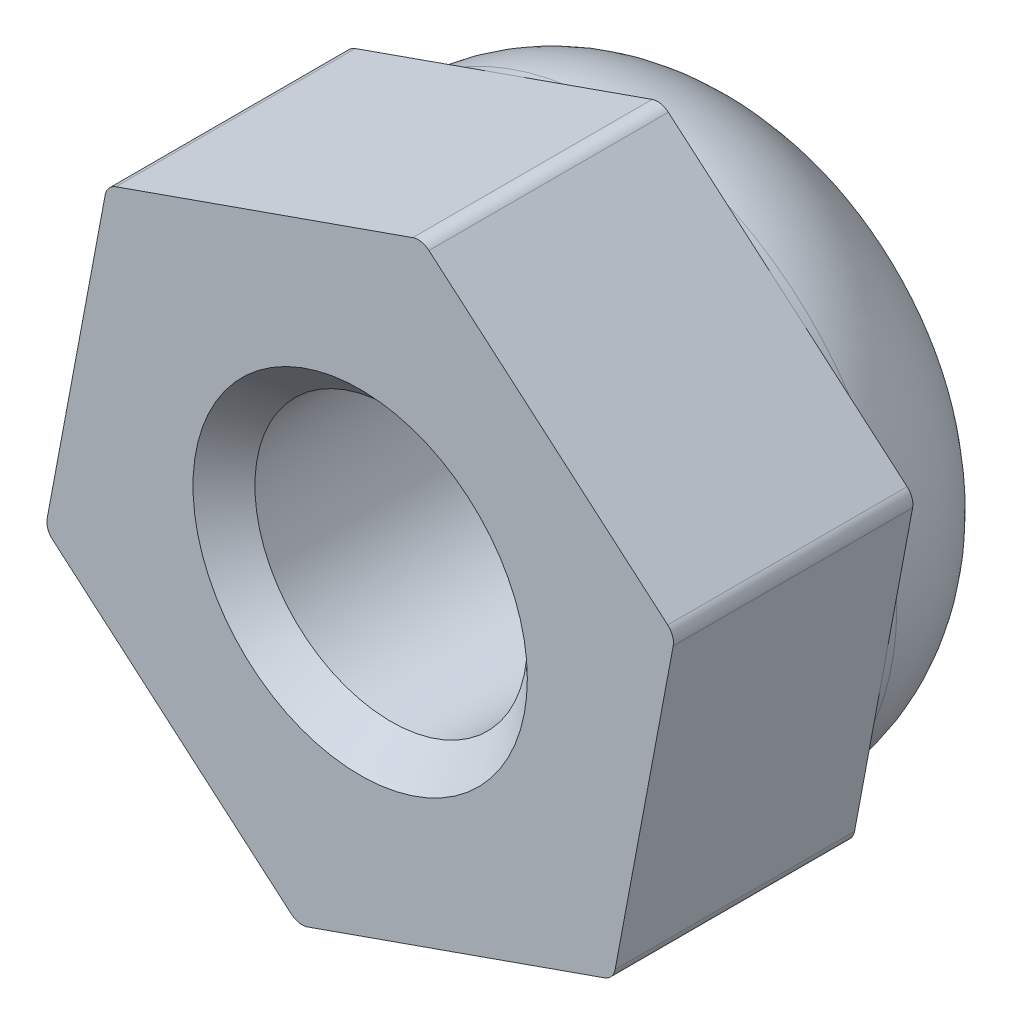
ISO-10303-21;
HEADER;
FILE_DESCRIPTION(('STEP AP214'),'2;1');
FILE_NAME('part.step','',(''),(''),'','','');
FILE_SCHEMA(('AUTOMOTIVE_DESIGN { 1 0 10303 214 1 1 1 1 }'));
ENDSEC;
DATA;
#1=APPLICATION_CONTEXT('core data for automotive mechanical design processes');
#2=APPLICATION_PROTOCOL_DEFINITION('international standard','automotive_design',2000,#1);
#3=PRODUCT_CONTEXT('',#1,'mechanical');
#4=PRODUCT('Part','Part','',(#3));
#5=PRODUCT_RELATED_PRODUCT_CATEGORY('part','',(#4));
#6=PRODUCT_DEFINITION_FORMATION('','',#4);
#7=PRODUCT_DEFINITION_CONTEXT('part definition',#1,'design');
#8=PRODUCT_DEFINITION('design','',#6,#7);
#9=PRODUCT_DEFINITION_SHAPE('','',#8);
#10=(LENGTH_UNIT() NAMED_UNIT(*) SI_UNIT(.MILLI.,.METRE.));
#11=(NAMED_UNIT(*) PLANE_ANGLE_UNIT() SI_UNIT($,.RADIAN.));
#12=(NAMED_UNIT(*) SI_UNIT($,.STERADIAN.) SOLID_ANGLE_UNIT());
#13=UNCERTAINTY_MEASURE_WITH_UNIT(LENGTH_MEASURE(1.E-05),#10,'distance_accuracy_value','');
#14=(GEOMETRIC_REPRESENTATION_CONTEXT(3) GLOBAL_UNCERTAINTY_ASSIGNED_CONTEXT((#13)) GLOBAL_UNIT_ASSIGNED_CONTEXT((#10,
#11,#12)) REPRESENTATION_CONTEXT('',''));
#15=CARTESIAN_POINT('',(0.,0.,0.));
#16=DIRECTION('',(0.,0.,1.));
#17=DIRECTION('',(1.,0.,0.));
#18=AXIS2_PLACEMENT_3D('',#15,#16,#17);
#19=CARTESIAN_POINT('',(0.,0.,0.));
#20=DIRECTION('',(0.,0.,1.));
#21=DIRECTION('',(1.,0.,0.));
#22=AXIS2_PLACEMENT_3D('',#19,#20,#21);
#23=PLANE('',#22);
#24=DIRECTION('',(-0.943398811601491,-0.331660492475205,0.));
#25=VECTOR('',#24,1.);
#26=CARTESIAN_POINT('',(0.745538728746312,3.97209080174065,0.));
#27=LINE('',#26,#25);
#28=CARTESIAN_POINT('',(0.636604417180052,3.93379394681862,0.));
#29=VERTEX_POINT('',#28);
#30=CARTESIAN_POINT('',(-1.16081172366322,3.30189584060522,0.));
#31=VERTEX_POINT('',#30);
#32=EDGE_CURVE('E199',#29,#31,#27,.T.);
#33=ORIENTED_EDGE('',*,*,#32,.F.);
#34=CARTESIAN_POINT('',(0.702936515675093,3.74511418449833,0.));
#35=DIRECTION('',(0.,0.,1.));
#36=DIRECTION('',(1.,0.,0.));
#37=AXIS2_PLACEMENT_3D('',#34,#35,#36);
#38=CIRCLE('',#37,0.2);
#39=CARTESIAN_POINT('',(0.833171933776962,3.89689934804151,0.));
#40=VERTEX_POINT('',#39);
#41=EDGE_CURVE('E264',#29,#40,#38,.F.);
#42=ORIENTED_EDGE('',*,*,#41,.T.);
#43=DIRECTION('',(-0.75892581771593,0.651177090509338,0.));
#44=VECTOR('',#43,1.);
#45=CARTESIAN_POINT('',(3.81270090481906,1.34038992227086,0.));
#46=LINE('',#45,#44);
#47=CARTESIAN_POINT('',(2.27911981678268,2.65624036200576,0.));
#48=VERTEX_POINT('',#47);
#49=EDGE_CURVE('E161',#48,#40,#46,.T.);
#50=ORIENTED_EDGE('',*,*,#49,.F.);
#51=CARTESIAN_POINT('',(0.,0.,0.));
#52=DIRECTION('',(0.,0.,1.));
#53=DIRECTION('',(1.,0.,0.));
#54=AXIS2_PLACEMENT_3D('',#51,#52,#53);
#55=CIRCLE('',#54,3.5);
#56=EDGE_CURVE('E174',#48,#31,#55,.T.);
#57=ORIENTED_EDGE('',*,*,#56,.T.);
#58=EDGE_LOOP('',(#33,#42,#50,#57));
#59=FACE_BOUND('',#58,.T.);
#60=ADVANCED_FACE('F40',(#59),#23,.F.);
#61=DIRECTION('',(-0.18447299388556,-0.982837582984543,0.));
#62=VECTOR('',#61,1.);
#63=CARTESIAN_POINT('',(-3.06716217607274,2.63170087946979,0.));
#64=LINE('',#63,#62);
#65=CARTESIAN_POINT('',(-3.08846328260835,2.51821257084862,0.));
#66=VERTEX_POINT('',#65);
#67=CARTESIAN_POINT('',(-3.4399315404459,0.645655478599461,0.));
#68=VERTEX_POINT('',#67);
#69=EDGE_CURVE('E203',#66,#68,#64,.T.);
#70=ORIENTED_EDGE('',*,*,#69,.F.);
#71=CARTESIAN_POINT('',(-2.89189576601144,2.48131797207151,0.));
#72=DIRECTION('',(0.,0.,1.));
#73=DIRECTION('',(1.,0.,0.));
#74=AXIS2_PLACEMENT_3D('',#71,#72,#73);
#75=CIRCLE('',#74,0.2);
#76=CARTESIAN_POINT('',(-2.95822786450649,2.66999773439181,0.));
#77=VERTEX_POINT('',#76);
#78=EDGE_CURVE('E274',#66,#77,#75,.F.);
#79=ORIENTED_EDGE('',*,*,#78,.T.);
#80=EDGE_CURVE('E198',#31,#77,#27,.T.);
#81=ORIENTED_EDGE('',*,*,#80,.F.);
#82=EDGE_CURVE('E421',#31,#68,#55,.T.);
#83=ORIENTED_EDGE('',*,*,#82,.T.);
#84=EDGE_LOOP('',(#70,#79,#81,#83));
#85=FACE_BOUND('',#84,.T.);
#86=ADVANCED_FACE('F350',(#85),#23,.F.);
#87=DIRECTION('',(0.75892581771593,-0.651177090509338,0.));
#88=VECTOR('',#87,1.);
#89=CARTESIAN_POINT('',(-3.81270090481905,-1.34038992227086,0.));
#90=LINE('',#89,#88);
#91=CARTESIAN_POINT('',(-3.7250676997884,-1.41558137597,0.));
#92=VERTEX_POINT('',#91);
#93=CARTESIAN_POINT('',(-2.27911981678268,-2.65624036200576,0.));
#94=VERTEX_POINT('',#93);
#95=EDGE_CURVE('E207',#92,#94,#90,.T.);
#96=ORIENTED_EDGE('',*,*,#95,.F.);
#97=CARTESIAN_POINT('',(-3.59483228168654,-1.26379621242681,0.));
#98=DIRECTION('',(0.,0.,1.));
#99=DIRECTION('',(1.,0.,0.));
#100=AXIS2_PLACEMENT_3D('',#97,#98,#99);
#101=CIRCLE('',#100,0.2);
#102=CARTESIAN_POINT('',(-3.79139979828345,-1.2269016136497,0.));
#103=VERTEX_POINT('',#102);
#104=EDGE_CURVE('E50',#92,#103,#101,.F.);
#105=ORIENTED_EDGE('',*,*,#104,.T.);
#106=EDGE_CURVE('E202',#68,#103,#64,.T.);
#107=ORIENTED_EDGE('',*,*,#106,.F.);
#108=EDGE_CURVE('E423',#68,#94,#55,.T.);
#109=ORIENTED_EDGE('',*,*,#108,.T.);
#110=EDGE_LOOP('',(#96,#105,#107,#109));
#111=FACE_BOUND('',#110,.T.);
#112=ADVANCED_FACE('F288',(#111),#23,.F.);
#113=DIRECTION('',(0.943398811601491,0.331660492475205,0.));
#114=VECTOR('',#113,1.);
#115=CARTESIAN_POINT('',(-0.74553872874631,-3.97209080174065,0.));
#116=LINE('',#115,#114);
#117=CARTESIAN_POINT('',(-0.636604417180051,-3.93379394681862,0.));
#118=VERTEX_POINT('',#117);
#119=CARTESIAN_POINT('',(1.16081172366322,-3.30189584060522,0.));
#120=VERTEX_POINT('',#119);
#121=EDGE_CURVE('E190',#118,#120,#116,.T.);
#122=ORIENTED_EDGE('',*,*,#121,.F.);
#123=CARTESIAN_POINT('',(-0.702936515675092,-3.74511418449833,0.));
#124=DIRECTION('',(0.,0.,1.));
#125=DIRECTION('',(1.,0.,0.));
#126=AXIS2_PLACEMENT_3D('',#123,#124,#125);
#127=CIRCLE('',#126,0.2);
#128=CARTESIAN_POINT('',(-0.833171933776959,-3.89689934804151,0.));
#129=VERTEX_POINT('',#128);
#130=EDGE_CURVE('E11',#118,#129,#127,.F.);
#131=ORIENTED_EDGE('',*,*,#130,.T.);
#132=EDGE_CURVE('E206',#94,#129,#90,.T.);
#133=ORIENTED_EDGE('',*,*,#132,.F.);
#134=EDGE_CURVE('E186',#94,#120,#55,.T.);
#135=ORIENTED_EDGE('',*,*,#134,.T.);
#136=EDGE_LOOP('',(#122,#131,#133,#135));
#137=FACE_BOUND('',#136,.T.);
#138=ADVANCED_FACE('F427',(#137),#23,.F.);
#139=DIRECTION('',(0.18447299388556,0.982837582984543,0.));
#140=VECTOR('',#139,1.);
#141=CARTESIAN_POINT('',(3.06716217607274,-2.63170087946979,0.));
#142=LINE('',#141,#140);
#143=CARTESIAN_POINT('',(3.08846328260835,-2.51821257084862,0.));
#144=VERTEX_POINT('',#143);
#145=CARTESIAN_POINT('',(3.4399315404459,-0.64565547859946,0.));
#146=VERTEX_POINT('',#145);
#147=EDGE_CURVE('E149',#144,#146,#142,.T.);
#148=ORIENTED_EDGE('',*,*,#147,.F.);
#149=CARTESIAN_POINT('',(2.89189576601145,-2.48131797207151,0.));
#150=DIRECTION('',(0.,0.,1.));
#151=DIRECTION('',(1.,0.,0.));
#152=AXIS2_PLACEMENT_3D('',#149,#150,#151);
#153=CIRCLE('',#152,0.2);
#154=CARTESIAN_POINT('',(2.95822786450649,-2.66999773439181,0.));
#155=VERTEX_POINT('',#154);
#156=EDGE_CURVE('E220',#144,#155,#153,.F.);
#157=ORIENTED_EDGE('',*,*,#156,.T.);
#158=EDGE_CURVE('E184',#120,#155,#116,.T.);
#159=ORIENTED_EDGE('',*,*,#158,.F.);
#160=EDGE_CURVE('E170',#120,#146,#55,.T.);
#161=ORIENTED_EDGE('',*,*,#160,.T.);
#162=EDGE_LOOP('',(#148,#157,#159,#161));
#163=FACE_BOUND('',#162,.T.);
#164=ADVANCED_FACE('F182',(#163),#23,.F.);
#165=CARTESIAN_POINT('',(-0.74553872874631,-3.97209080174065,2.9));
#166=DIRECTION('',(-0.331660492475205,0.943398811601491,0.));
#167=DIRECTION('',(-0.943398811601491,-0.331660492475205,0.));
#168=AXIS2_PLACEMENT_3D('',#165,#166,#167);
#169=PLANE('',#168);
#170=ORIENTED_EDGE('',*,*,#158,.T.);
#171=DIRECTION('',(0.,0.,-1.));
#172=VECTOR('',#171,1.);
#173=CARTESIAN_POINT('',(2.95822786450649,-2.66999773439181,2.9));
#174=LINE('',#173,#172);
#175=CARTESIAN_POINT('',(2.95822786450649,-2.66999773439181,2.9));
#176=VERTEX_POINT('',#175);
#177=EDGE_CURVE('E227',#155,#176,#174,.F.);
#178=ORIENTED_EDGE('',*,*,#177,.T.);
#179=DIRECTION('',(0.943398811601491,0.331660492475205,0.));
#180=VECTOR('',#179,1.);
#181=CARTESIAN_POINT('',(-0.74553872874631,-3.97209080174065,2.9));
#182=LINE('',#181,#180);
#183=CARTESIAN_POINT('',(-0.636604417180051,-3.93379394681862,2.9));
#184=VERTEX_POINT('',#183);
#185=EDGE_CURVE('E209',#184,#176,#182,.T.);
#186=ORIENTED_EDGE('',*,*,#185,.F.);
#187=DIRECTION('',(0.,0.,-1.));
#188=VECTOR('',#187,1.);
#189=CARTESIAN_POINT('',(-0.636604417180051,-3.93379394681862,2.9));
#190=LINE('',#189,#188);
#191=EDGE_CURVE('E223',#184,#118,#190,.T.);
#192=ORIENTED_EDGE('',*,*,#191,.T.);
#193=ORIENTED_EDGE('',*,*,#121,.T.);
#194=EDGE_LOOP('',(#170,#178,#186,#192,#193));
#195=FACE_BOUND('',#194,.T.);
#196=ADVANCED_FACE('F371',(#195),#169,.F.);
#197=CARTESIAN_POINT('',(3.06716217607274,-2.63170087946979,2.9));
#198=DIRECTION('',(-0.982837582984543,0.18447299388556,0.));
#199=DIRECTION('',(-0.18447299388556,-0.982837582984543,0.));
#200=AXIS2_PLACEMENT_3D('',#197,#198,#199);
#201=PLANE('',#200);
#202=DIRECTION('',(0.18447299388556,0.982837582984543,0.));
#203=VECTOR('',#202,1.);
#204=CARTESIAN_POINT('',(3.06716217607274,-2.63170087946979,2.9));
#205=LINE('',#204,#203);
#206=CARTESIAN_POINT('',(3.08846328260835,-2.51821257084862,2.9));
#207=VERTEX_POINT('',#206);
#208=CARTESIAN_POINT('',(3.79139979828345,1.2269016136497,2.9));
#209=VERTEX_POINT('',#208);
#210=EDGE_CURVE('E321',#207,#209,#205,.T.);
#211=ORIENTED_EDGE('',*,*,#210,.F.);
#212=DIRECTION('',(0.,0.,-1.));
#213=VECTOR('',#212,1.);
#214=CARTESIAN_POINT('',(3.08846328260835,-2.51821257084862,2.9));
#215=LINE('',#214,#213);
#216=EDGE_CURVE('E157',#207,#144,#215,.T.);
#217=ORIENTED_EDGE('',*,*,#216,.T.);
#218=ORIENTED_EDGE('',*,*,#147,.T.);
#219=CARTESIAN_POINT('',(3.79139979828345,1.2269016136497,0.));
#220=VERTEX_POINT('',#219);
#221=EDGE_CURVE('E154',#146,#220,#142,.T.);
#222=ORIENTED_EDGE('',*,*,#221,.T.);
#223=DIRECTION('',(0.,0.,-1.));
#224=VECTOR('',#223,1.);
#225=CARTESIAN_POINT('',(3.79139979828345,1.2269016136497,2.9));
#226=LINE('',#225,#224);
#227=EDGE_CURVE('E215',#220,#209,#226,.F.);
#228=ORIENTED_EDGE('',*,*,#227,.T.);
#229=EDGE_LOOP('',(#211,#217,#218,#222,#228));
#230=FACE_BOUND('',#229,.T.);
#231=ADVANCED_FACE('F152',(#230),#201,.F.);
#232=CARTESIAN_POINT('',(3.81270090481906,1.34038992227086,2.9));
#233=DIRECTION('',(-0.651177090509338,-0.75892581771593,0.));
#234=DIRECTION('',(0.75892581771593,-0.651177090509338,0.));
#235=AXIS2_PLACEMENT_3D('',#232,#233,#234);
#236=PLANE('',#235);
#237=DIRECTION('',(-0.75892581771593,0.651177090509338,0.));
#238=VECTOR('',#237,1.);
#239=CARTESIAN_POINT('',(3.81270090481906,1.34038992227086,2.9));
#240=LINE('',#239,#238);
#241=CARTESIAN_POINT('',(3.72506769978841,1.41558137597,2.9));
#242=VERTEX_POINT('',#241);
#243=CARTESIAN_POINT('',(0.833171933776962,3.89689934804151,2.9));
#244=VERTEX_POINT('',#243);
#245=EDGE_CURVE('E317',#242,#244,#240,.T.);
#246=ORIENTED_EDGE('',*,*,#245,.F.);
#247=DIRECTION('',(0.,0.,-1.));
#248=VECTOR('',#247,1.);
#249=CARTESIAN_POINT('',(3.72506769978841,1.41558137597,2.9));
#250=LINE('',#249,#248);
#251=CARTESIAN_POINT('',(3.72506769978841,1.41558137597,0.));
#252=VERTEX_POINT('',#251);
#253=EDGE_CURVE('E251',#242,#252,#250,.T.);
#254=ORIENTED_EDGE('',*,*,#253,.T.);
#255=EDGE_CURVE('E195',#252,#48,#46,.T.);
#256=ORIENTED_EDGE('',*,*,#255,.T.);
#257=ORIENTED_EDGE('',*,*,#49,.T.);
#258=DIRECTION('',(0.,0.,-1.));
#259=VECTOR('',#258,1.);
#260=CARTESIAN_POINT('',(0.833171933776961,3.89689934804151,2.9));
#261=LINE('',#260,#259);
#262=EDGE_CURVE('E248',#40,#244,#261,.F.);
#263=ORIENTED_EDGE('',*,*,#262,.T.);
#264=EDGE_LOOP('',(#246,#254,#256,#257,#263));
#265=FACE_BOUND('',#264,.T.);
#266=ADVANCED_FACE('F364',(#265),#236,.F.);
#267=CARTESIAN_POINT('',(0.745538728746312,3.97209080174065,2.9));
#268=DIRECTION('',(0.331660492475205,-0.943398811601491,0.));
#269=DIRECTION('',(0.943398811601491,0.331660492475205,0.));
#270=AXIS2_PLACEMENT_3D('',#267,#268,#269);
#271=PLANE('',#270);
#272=DIRECTION('',(-0.943398811601491,-0.331660492475205,0.));
#273=VECTOR('',#272,1.);
#274=CARTESIAN_POINT('',(0.745538728746312,3.97209080174065,2.9));
#275=LINE('',#274,#273);
#276=CARTESIAN_POINT('',(0.636604417180052,3.93379394681862,2.9));
#277=VERTEX_POINT('',#276);
#278=CARTESIAN_POINT('',(-2.95822786450649,2.66999773439181,2.9));
#279=VERTEX_POINT('',#278);
#280=EDGE_CURVE('E311',#277,#279,#275,.T.);
#281=ORIENTED_EDGE('',*,*,#280,.F.);
#282=DIRECTION('',(0.,0.,-1.));
#283=VECTOR('',#282,1.);
#284=CARTESIAN_POINT('',(0.636604417180052,3.93379394681862,2.9));
#285=LINE('',#284,#283);
#286=EDGE_CURVE('E260',#277,#29,#285,.T.);
#287=ORIENTED_EDGE('',*,*,#286,.T.);
#288=ORIENTED_EDGE('',*,*,#32,.T.);
#289=ORIENTED_EDGE('',*,*,#80,.T.);
#290=DIRECTION('',(0.,0.,-1.));
#291=VECTOR('',#290,1.);
#292=CARTESIAN_POINT('',(-2.95822786450649,2.66999773439181,2.9));
#293=LINE('',#292,#291);
#294=EDGE_CURVE('E257',#77,#279,#293,.F.);
#295=ORIENTED_EDGE('',*,*,#294,.T.);
#296=EDGE_LOOP('',(#281,#287,#288,#289,#295));
#297=FACE_BOUND('',#296,.T.);
#298=ADVANCED_FACE('F361',(#297),#271,.F.);
#299=CARTESIAN_POINT('',(-3.06716217607274,2.63170087946979,2.9));
#300=DIRECTION('',(0.982837582984543,-0.18447299388556,0.));
#301=DIRECTION('',(0.18447299388556,0.982837582984543,0.));
#302=AXIS2_PLACEMENT_3D('',#299,#300,#301);
#303=PLANE('',#302);
#304=DIRECTION('',(-0.18447299388556,-0.982837582984543,0.));
#305=VECTOR('',#304,1.);
#306=CARTESIAN_POINT('',(-3.06716217607274,2.63170087946979,2.9));
#307=LINE('',#306,#305);
#308=CARTESIAN_POINT('',(-3.08846328260835,2.51821257084862,2.9));
#309=VERTEX_POINT('',#308);
#310=CARTESIAN_POINT('',(-3.79139979828345,-1.2269016136497,2.9));
#311=VERTEX_POINT('',#310);
#312=EDGE_CURVE('E305',#309,#311,#307,.T.);
#313=ORIENTED_EDGE('',*,*,#312,.F.);
#314=DIRECTION('',(0.,0.,-1.));
#315=VECTOR('',#314,1.);
#316=CARTESIAN_POINT('',(-3.08846328260835,2.51821257084862,2.9));
#317=LINE('',#316,#315);
#318=EDGE_CURVE('E270',#309,#66,#317,.T.);
#319=ORIENTED_EDGE('',*,*,#318,.T.);
#320=ORIENTED_EDGE('',*,*,#69,.T.);
#321=ORIENTED_EDGE('',*,*,#106,.T.);
#322=DIRECTION('',(0.,0.,-1.));
#323=VECTOR('',#322,1.);
#324=CARTESIAN_POINT('',(-3.79139979828345,-1.2269016136497,2.9));
#325=LINE('',#324,#323);
#326=EDGE_CURVE('E267',#103,#311,#325,.F.);
#327=ORIENTED_EDGE('',*,*,#326,.T.);
#328=EDGE_LOOP('',(#313,#319,#320,#321,#327));
#329=FACE_BOUND('',#328,.T.);
#330=ADVANCED_FACE('F292',(#329),#303,.F.);
#331=CARTESIAN_POINT('',(-3.81270090481905,-1.34038992227086,2.9));
#332=DIRECTION('',(0.651177090509338,0.75892581771593,0.));
#333=DIRECTION('',(-0.75892581771593,0.651177090509338,0.));
#334=AXIS2_PLACEMENT_3D('',#331,#332,#333);
#335=PLANE('',#334);
#336=DIRECTION('',(0.75892581771593,-0.651177090509338,0.));
#337=VECTOR('',#336,1.);
#338=CARTESIAN_POINT('',(-3.81270090481905,-1.34038992227086,2.9));
#339=LINE('',#338,#337);
#340=CARTESIAN_POINT('',(-3.7250676997884,-1.41558137597,2.9));
#341=VERTEX_POINT('',#340);
#342=CARTESIAN_POINT('',(-0.833171933776959,-3.89689934804151,2.9));
#343=VERTEX_POINT('',#342);
#344=EDGE_CURVE('E179',#341,#343,#339,.T.);
#345=ORIENTED_EDGE('',*,*,#344,.F.);
#346=DIRECTION('',(0.,0.,-1.));
#347=VECTOR('',#346,1.);
#348=CARTESIAN_POINT('',(-3.7250676997884,-1.41558137597,2.9));
#349=LINE('',#348,#347);
#350=EDGE_CURVE('E280',#341,#92,#349,.T.);
#351=ORIENTED_EDGE('',*,*,#350,.T.);
#352=ORIENTED_EDGE('',*,*,#95,.T.);
#353=ORIENTED_EDGE('',*,*,#132,.T.);
#354=DIRECTION('',(0.,0.,-1.));
#355=VECTOR('',#354,1.);
#356=CARTESIAN_POINT('',(-0.833171933776959,-3.89689934804151,2.9));
#357=LINE('',#356,#355);
#358=EDGE_CURVE('E277',#129,#343,#357,.F.);
#359=ORIENTED_EDGE('',*,*,#358,.T.);
#360=EDGE_LOOP('',(#345,#351,#352,#353,#359));
#361=FACE_BOUND('',#360,.T.);
#362=ADVANCED_FACE('F307',(#361),#335,.F.);
#363=CARTESIAN_POINT('',(0.,0.,2.9));
#364=DIRECTION('',(0.,0.,1.));
#365=DIRECTION('',(1.,0.,0.));
#366=AXIS2_PLACEMENT_3D('',#363,#364,#365);
#367=PLANE('',#366);
#368=CARTESIAN_POINT('',(0.,0.,2.9));
#369=DIRECTION('',(0.,0.,1.));
#370=DIRECTION('',(1.,0.,0.));
#371=AXIS2_PLACEMENT_3D('',#368,#369,#370);
#372=CIRCLE('',#371,2.025);
#373=CARTESIAN_POINT('',(2.025,0.,2.9));
#374=VERTEX_POINT('',#373);
#375=EDGE_CURVE('E331',#374,#374,#372,.T.);
#376=ORIENTED_EDGE('',*,*,#375,.F.);
#377=EDGE_LOOP('',(#376));
#378=FACE_BOUND('',#377,.T.);
#379=ORIENTED_EDGE('',*,*,#185,.T.);
#380=CARTESIAN_POINT('',(2.89189576601145,-2.48131797207151,2.9));
#381=DIRECTION('',(0.,0.,1.));
#382=DIRECTION('',(1.,0.,0.));
#383=AXIS2_PLACEMENT_3D('',#380,#381,#382);
#384=CIRCLE('',#383,0.2);
#385=EDGE_CURVE('E245',#176,#207,#384,.T.);
#386=ORIENTED_EDGE('',*,*,#385,.T.);
#387=ORIENTED_EDGE('',*,*,#210,.T.);
#388=CARTESIAN_POINT('',(3.59483228168654,1.26379621242681,2.9));
#389=DIRECTION('',(0.,0.,1.));
#390=DIRECTION('',(1.,0.,0.));
#391=AXIS2_PLACEMENT_3D('',#388,#389,#390);
#392=CIRCLE('',#391,0.2);
#393=EDGE_CURVE('E242',#209,#242,#392,.T.);
#394=ORIENTED_EDGE('',*,*,#393,.T.);
#395=ORIENTED_EDGE('',*,*,#245,.T.);
#396=CARTESIAN_POINT('',(0.702936515675093,3.74511418449833,2.9));
#397=DIRECTION('',(0.,0.,1.));
#398=DIRECTION('',(1.,0.,0.));
#399=AXIS2_PLACEMENT_3D('',#396,#397,#398);
#400=CIRCLE('',#399,0.2);
#401=EDGE_CURVE('E239',#244,#277,#400,.T.);
#402=ORIENTED_EDGE('',*,*,#401,.T.);
#403=ORIENTED_EDGE('',*,*,#280,.T.);
#404=CARTESIAN_POINT('',(-2.89189576601144,2.48131797207151,2.9));
#405=DIRECTION('',(0.,0.,1.));
#406=DIRECTION('',(1.,0.,0.));
#407=AXIS2_PLACEMENT_3D('',#404,#405,#406);
#408=CIRCLE('',#407,0.2);
#409=EDGE_CURVE('E236',#279,#309,#408,.T.);
#410=ORIENTED_EDGE('',*,*,#409,.T.);
#411=ORIENTED_EDGE('',*,*,#312,.T.);
#412=CARTESIAN_POINT('',(-3.59483228168654,-1.26379621242681,2.9));
#413=DIRECTION('',(0.,0.,1.));
#414=DIRECTION('',(1.,0.,0.));
#415=AXIS2_PLACEMENT_3D('',#412,#413,#414);
#416=CIRCLE('',#415,0.2);
#417=EDGE_CURVE('E233',#311,#341,#416,.T.);
#418=ORIENTED_EDGE('',*,*,#417,.T.);
#419=ORIENTED_EDGE('',*,*,#344,.T.);
#420=CARTESIAN_POINT('',(-0.702936515675092,-3.74511418449833,2.9));
#421=DIRECTION('',(0.,0.,1.));
#422=DIRECTION('',(1.,0.,0.));
#423=AXIS2_PLACEMENT_3D('',#420,#421,#422);
#424=CIRCLE('',#423,0.2);
#425=EDGE_CURVE('E230',#343,#184,#424,.T.);
#426=ORIENTED_EDGE('',*,*,#425,.T.);
#427=EDGE_LOOP('',(#379,#386,#387,#394,#395,#402,#403,#410,#411,#418,#419,#426));
#428=FACE_BOUND('',#427,.T.);
#429=ADVANCED_FACE('F303',(#378,#428),#367,.T.);
#430=ORIENTED_EDGE('',*,*,#255,.F.);
#431=CARTESIAN_POINT('',(3.59483228168654,1.26379621242681,0.));
#432=DIRECTION('',(0.,0.,1.));
#433=DIRECTION('',(1.,0.,0.));
#434=AXIS2_PLACEMENT_3D('',#431,#432,#433);
#435=CIRCLE('',#434,0.2);
#436=EDGE_CURVE('E188',#252,#220,#435,.F.);
#437=ORIENTED_EDGE('',*,*,#436,.T.);
#438=ORIENTED_EDGE('',*,*,#221,.F.);
#439=EDGE_CURVE('E167',#146,#48,#55,.T.);
#440=ORIENTED_EDGE('',*,*,#439,.T.);
#441=EDGE_LOOP('',(#430,#437,#438,#440));
#442=FACE_BOUND('',#441,.T.);
#443=ADVANCED_FACE('F187',(#442),#23,.F.);
#444=CARTESIAN_POINT('',(0.,0.,-2.1));
#445=DIRECTION('',(0.,0.,1.));
#446=DIRECTION('',(1.,0.,0.));
#447=AXIS2_PLACEMENT_3D('',#444,#445,#446);
#448=CYLINDRICAL_SURFACE('',#447,3.5);
#449=CARTESIAN_POINT('',(0.,0.,-0.1));
#450=DIRECTION('',(0.,0.,1.));
#451=DIRECTION('',(1.,0.,0.));
#452=AXIS2_PLACEMENT_3D('',#449,#450,#451);
#453=CIRCLE('',#452,3.5);
#454=CARTESIAN_POINT('',(3.5,0.,-0.1));
#455=VERTEX_POINT('',#454);
#456=EDGE_CURVE('E211',#455,#455,#453,.T.);
#457=ORIENTED_EDGE('',*,*,#456,.T.);
#458=EDGE_LOOP('',(#457));
#459=FACE_BOUND('',#458,.T.);
#460=ORIENTED_EDGE('',*,*,#56,.F.);
#461=ORIENTED_EDGE('',*,*,#439,.F.);
#462=ORIENTED_EDGE('',*,*,#160,.F.);
#463=ORIENTED_EDGE('',*,*,#134,.F.);
#464=ORIENTED_EDGE('',*,*,#108,.F.);
#465=ORIENTED_EDGE('',*,*,#82,.F.);
#466=EDGE_LOOP('',(#460,#461,#462,#463,#464,#465));
#467=FACE_BOUND('',#466,.T.);
#468=ADVANCED_FACE('F168',(#459,#467),#448,.T.);
#469=CARTESIAN_POINT('',(0.,0.,-0.1));
#470=DIRECTION('',(0.,0.,1.));
#471=DIRECTION('',(1.,0.,0.));
#472=AXIS2_PLACEMENT_3D('',#469,#470,#471);
#473=DEGENERATE_TOROIDAL_SURFACE('',#472,1.5,2.,.T.);
#474=CARTESIAN_POINT('',(0.,0.,-2.09436706751791));
#475=DIRECTION('',(0.,0.,1.));
#476=DIRECTION('',(1.,0.,0.));
#477=AXIS2_PLACEMENT_3D('',#474,#475,#476);
#478=CIRCLE('',#477,1.65);
#479=CARTESIAN_POINT('',(1.65,0.,-2.09436706751791));
#480=VERTEX_POINT('',#479);
#481=EDGE_CURVE('E44',#480,#480,#478,.F.);
#482=ORIENTED_EDGE('',*,*,#481,.F.);
#483=EDGE_LOOP('',(#482));
#484=FACE_BOUND('',#483,.T.);
#485=ORIENTED_EDGE('',*,*,#456,.F.);
#486=EDGE_LOOP('',(#485));
#487=FACE_BOUND('',#486,.T.);
#488=ADVANCED_FACE('F375',(#484,#487),#473,.T.);
#489=CARTESIAN_POINT('',(2.89189576601145,-2.48131797207151,2.9));
#490=DIRECTION('',(0.,0.,-1.));
#491=DIRECTION('',(-1.,0.,0.));
#492=AXIS2_PLACEMENT_3D('',#489,#490,#491);
#493=CYLINDRICAL_SURFACE('',#492,0.2);
#494=ORIENTED_EDGE('',*,*,#385,.F.);
#495=ORIENTED_EDGE('',*,*,#177,.F.);
#496=ORIENTED_EDGE('',*,*,#156,.F.);
#497=ORIENTED_EDGE('',*,*,#216,.F.);
#498=EDGE_LOOP('',(#494,#495,#496,#497));
#499=FACE_BOUND('',#498,.T.);
#500=ADVANCED_FACE('F377',(#499),#493,.T.);
#501=CARTESIAN_POINT('',(3.59483228168654,1.26379621242681,2.9));
#502=DIRECTION('',(0.,0.,-1.));
#503=DIRECTION('',(-1.,0.,0.));
#504=AXIS2_PLACEMENT_3D('',#501,#502,#503);
#505=CYLINDRICAL_SURFACE('',#504,0.2);
#506=ORIENTED_EDGE('',*,*,#393,.F.);
#507=ORIENTED_EDGE('',*,*,#227,.F.);
#508=ORIENTED_EDGE('',*,*,#436,.F.);
#509=ORIENTED_EDGE('',*,*,#253,.F.);
#510=EDGE_LOOP('',(#506,#507,#508,#509));
#511=FACE_BOUND('',#510,.T.);
#512=ADVANCED_FACE('F381',(#511),#505,.T.);
#513=CARTESIAN_POINT('',(0.702936515675093,3.74511418449833,2.9));
#514=DIRECTION('',(0.,0.,-1.));
#515=DIRECTION('',(-1.,0.,0.));
#516=AXIS2_PLACEMENT_3D('',#513,#514,#515);
#517=CYLINDRICAL_SURFACE('',#516,0.2);
#518=ORIENTED_EDGE('',*,*,#401,.F.);
#519=ORIENTED_EDGE('',*,*,#262,.F.);
#520=ORIENTED_EDGE('',*,*,#41,.F.);
#521=ORIENTED_EDGE('',*,*,#286,.F.);
#522=EDGE_LOOP('',(#518,#519,#520,#521));
#523=FACE_BOUND('',#522,.T.);
#524=ADVANCED_FACE('F385',(#523),#517,.T.);
#525=CARTESIAN_POINT('',(-2.89189576601144,2.48131797207151,2.9));
#526=DIRECTION('',(0.,0.,-1.));
#527=DIRECTION('',(-1.,0.,0.));
#528=AXIS2_PLACEMENT_3D('',#525,#526,#527);
#529=CYLINDRICAL_SURFACE('',#528,0.2);
#530=ORIENTED_EDGE('',*,*,#409,.F.);
#531=ORIENTED_EDGE('',*,*,#294,.F.);
#532=ORIENTED_EDGE('',*,*,#78,.F.);
#533=ORIENTED_EDGE('',*,*,#318,.F.);
#534=EDGE_LOOP('',(#530,#531,#532,#533));
#535=FACE_BOUND('',#534,.T.);
#536=ADVANCED_FACE('F389',(#535),#529,.T.);
#537=CARTESIAN_POINT('',(-3.59483228168654,-1.26379621242681,2.9));
#538=DIRECTION('',(0.,0.,-1.));
#539=DIRECTION('',(-1.,0.,0.));
#540=AXIS2_PLACEMENT_3D('',#537,#538,#539);
#541=CYLINDRICAL_SURFACE('',#540,0.2);
#542=ORIENTED_EDGE('',*,*,#417,.F.);
#543=ORIENTED_EDGE('',*,*,#326,.F.);
#544=ORIENTED_EDGE('',*,*,#104,.F.);
#545=ORIENTED_EDGE('',*,*,#350,.F.);
#546=EDGE_LOOP('',(#542,#543,#544,#545));
#547=FACE_BOUND('',#546,.T.);
#548=ADVANCED_FACE('F298',(#547),#541,.T.);
#549=CARTESIAN_POINT('',(-0.702936515675092,-3.74511418449833,2.9));
#550=DIRECTION('',(0.,0.,-1.));
#551=DIRECTION('',(-1.,0.,0.));
#552=AXIS2_PLACEMENT_3D('',#549,#550,#551);
#553=CYLINDRICAL_SURFACE('',#552,0.2);
#554=ORIENTED_EDGE('',*,*,#425,.F.);
#555=ORIENTED_EDGE('',*,*,#358,.F.);
#556=ORIENTED_EDGE('',*,*,#130,.F.);
#557=ORIENTED_EDGE('',*,*,#191,.F.);
#558=EDGE_LOOP('',(#554,#555,#556,#557));
#559=FACE_BOUND('',#558,.T.);
#560=ADVANCED_FACE('F42',(#559),#553,.T.);
#561=CARTESIAN_POINT('',(0.,0.,2.9));
#562=DIRECTION('',(0.,0.,1.));
#563=DIRECTION('',(1.,0.,0.));
#564=AXIS2_PLACEMENT_3D('',#561,#562,#563);
#565=CYLINDRICAL_SURFACE('',#564,1.65);
#566=ORIENTED_EDGE('',*,*,#481,.T.);
#567=EDGE_LOOP('',(#566));
#568=FACE_BOUND('',#567,.T.);
#569=CARTESIAN_POINT('',(0.,0.,2.525));
#570=DIRECTION('',(0.,0.,1.));
#571=DIRECTION('',(1.,0.,0.));
#572=AXIS2_PLACEMENT_3D('',#569,#570,#571);
#573=CIRCLE('',#572,1.65);
#574=CARTESIAN_POINT('',(1.65,0.,2.525));
#575=VERTEX_POINT('',#574);
#576=EDGE_CURVE('E327',#575,#575,#573,.T.);
#577=ORIENTED_EDGE('',*,*,#576,.T.);
#578=EDGE_LOOP('',(#577));
#579=FACE_BOUND('',#578,.T.);
#580=ADVANCED_FACE('F397',(#568,#579),#565,.F.);
#581=CARTESIAN_POINT('',(0.,0.,2.9));
#582=DIRECTION('',(0.,0.,1.));
#583=DIRECTION('',(1.,0.,0.));
#584=AXIS2_PLACEMENT_3D('',#581,#582,#583);
#585=CONICAL_SURFACE('',#584,2.025,0.785398163397448);
#586=ORIENTED_EDGE('',*,*,#576,.F.);
#587=EDGE_LOOP('',(#586));
#588=FACE_BOUND('',#587,.T.);
#589=ORIENTED_EDGE('',*,*,#375,.T.);
#590=EDGE_LOOP('',(#589));
#591=FACE_BOUND('',#590,.T.);
#592=ADVANCED_FACE('F336',(#588,#591),#585,.F.);
#593=CLOSED_SHELL('',(#60,#86,#112,#138,#164,#196,#231,#266,#298,#330,#362,#429,#443,#468,#488,
#500,#512,#524,#536,#548,#560,#580,#592));
#594=MANIFOLD_SOLID_BREP('B2',#593);
#595=ADVANCED_BREP_SHAPE_REPRESENTATION('',(#18,#594),#14);
#596=SHAPE_DEFINITION_REPRESENTATION(#9,#595);
ENDSEC;
END-ISO-10303-21;
